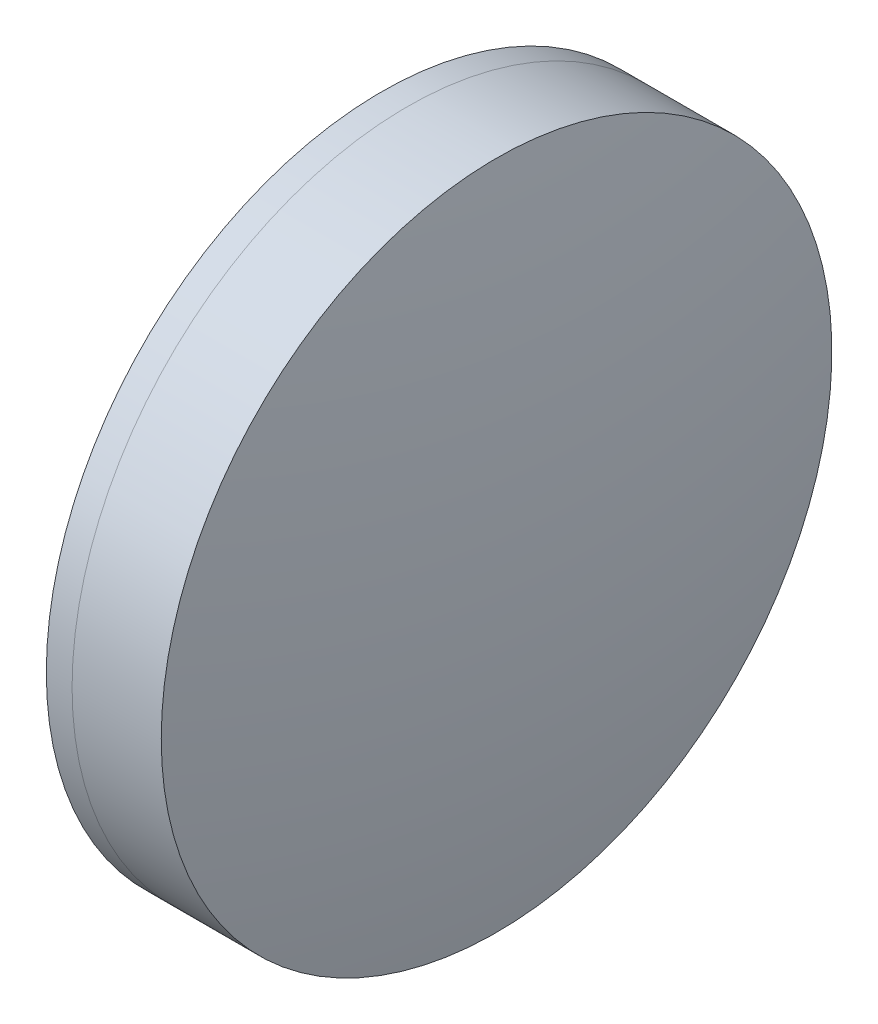
ISO-10303-21;
HEADER;
FILE_DESCRIPTION(('STEP AP214'),'2;1');
FILE_NAME('part.step','',(''),(''),'','','');
FILE_SCHEMA(('AUTOMOTIVE_DESIGN { 1 0 10303 214 1 1 1 1 }'));
ENDSEC;
DATA;
#1=APPLICATION_CONTEXT('core data for automotive mechanical design processes');
#2=APPLICATION_PROTOCOL_DEFINITION('international standard','automotive_design',2000,#1);
#3=PRODUCT_CONTEXT('',#1,'mechanical');
#4=PRODUCT('Part','Part','',(#3));
#5=PRODUCT_RELATED_PRODUCT_CATEGORY('part','',(#4));
#6=PRODUCT_DEFINITION_FORMATION('','',#4);
#7=PRODUCT_DEFINITION_CONTEXT('part definition',#1,'design');
#8=PRODUCT_DEFINITION('design','',#6,#7);
#9=PRODUCT_DEFINITION_SHAPE('','',#8);
#10=(LENGTH_UNIT() NAMED_UNIT(*) SI_UNIT(.MILLI.,.METRE.));
#11=(NAMED_UNIT(*) PLANE_ANGLE_UNIT() SI_UNIT($,.RADIAN.));
#12=(NAMED_UNIT(*) SI_UNIT($,.STERADIAN.) SOLID_ANGLE_UNIT());
#13=UNCERTAINTY_MEASURE_WITH_UNIT(LENGTH_MEASURE(1.E-05),#10,'distance_accuracy_value','');
#14=(GEOMETRIC_REPRESENTATION_CONTEXT(3) GLOBAL_UNCERTAINTY_ASSIGNED_CONTEXT((#13)) GLOBAL_UNIT_ASSIGNED_CONTEXT((#10,
#11,#12)) REPRESENTATION_CONTEXT('',''));
#15=CARTESIAN_POINT('',(0.,0.,0.));
#16=DIRECTION('',(0.,0.,1.));
#17=DIRECTION('',(1.,0.,0.));
#18=AXIS2_PLACEMENT_3D('',#15,#16,#17);
#19=CARTESIAN_POINT('',(181.48845515743,0.,0.));
#20=DIRECTION('',(-1.,0.,0.));
#21=DIRECTION('',(0.,0.,1.));
#22=AXIS2_PLACEMENT_3D('',#19,#20,#21);
#23=SPHERICAL_SURFACE('',#22,48.197);
#24=CARTESIAN_POINT('',(222.694653829474,0.,0.));
#25=DIRECTION('',(-1.,0.,0.));
#26=DIRECTION('',(0.,0.,1.));
#27=AXIS2_PLACEMENT_3D('',#24,#25,#26);
#28=CIRCLE('',#27,25.);
#29=CARTESIAN_POINT('',(222.694653829474,0.,25.));
#30=VERTEX_POINT('',#29);
#31=EDGE_CURVE('E11',#30,#30,#28,.T.);
#32=ORIENTED_EDGE('',*,*,#31,.T.);
#33=EDGE_LOOP('',(#32));
#34=FACE_BOUND('',#33,.T.);
#35=ADVANCED_FACE('F45',(#34),#23,.F.);
#36=CARTESIAN_POINT('',(-0.551919992657797,0.,0.));
#37=DIRECTION('',(-1.,0.,0.));
#38=DIRECTION('',(0.,0.,1.));
#39=AXIS2_PLACEMENT_3D('',#36,#37,#38);
#40=CYLINDRICAL_SURFACE('',#39,25.);
#41=CARTESIAN_POINT('',(229.343243300927,0.,0.));
#42=DIRECTION('',(-1.,0.,0.));
#43=DIRECTION('',(0.,0.,1.));
#44=AXIS2_PLACEMENT_3D('',#41,#42,#43);
#45=CIRCLE('',#44,25.);
#46=CARTESIAN_POINT('',(229.343243300927,0.,25.));
#47=VERTEX_POINT('',#46);
#48=EDGE_CURVE('E51',#47,#47,#45,.T.);
#49=ORIENTED_EDGE('',*,*,#48,.T.);
#50=EDGE_LOOP('',(#49));
#51=FACE_BOUND('',#50,.T.);
#52=ORIENTED_EDGE('',*,*,#31,.F.);
#53=EDGE_LOOP('',(#52));
#54=FACE_BOUND('',#53,.T.);
#55=ADVANCED_FACE('F57',(#51,#54),#40,.T.);
#56=CARTESIAN_POINT('',(97.0934551574296,0.,0.));
#57=DIRECTION('',(-1.,0.,0.));
#58=DIRECTION('',(0.,0.,1.));
#59=AXIS2_PLACEMENT_3D('',#56,#57,#58);
#60=SPHERICAL_SURFACE('',#59,134.592);
#61=ORIENTED_EDGE('',*,*,#48,.F.);
#62=EDGE_LOOP('',(#61));
#63=FACE_BOUND('',#62,.T.);
#64=ADVANCED_FACE('F60',(#63),#60,.T.);
#65=CLOSED_SHELL('',(#35,#55,#64));
#66=MANIFOLD_SOLID_BREP('B2',#65);
#67=CARTESIAN_POINT('',(281.05545515743,0.,0.));
#68=DIRECTION('',(-1.,0.,0.));
#69=DIRECTION('',(0.,0.,1.));
#70=AXIS2_PLACEMENT_3D('',#67,#68,#69);
#71=SPHERICAL_SURFACE('',#70,65.26);
#72=CARTESIAN_POINT('',(220.773885834792,0.,0.));
#73=DIRECTION('',(-1.,0.,0.));
#74=DIRECTION('',(0.,0.,1.));
#75=AXIS2_PLACEMENT_3D('',#72,#73,#74);
#76=CIRCLE('',#75,25.);
#77=CARTESIAN_POINT('',(220.773885834792,0.,25.));
#78=VERTEX_POINT('',#77);
#79=EDGE_CURVE('E44',#78,#78,#76,.T.);
#80=ORIENTED_EDGE('',*,*,#79,.T.);
#81=EDGE_LOOP('',(#80));
#82=FACE_BOUND('',#81,.T.);
#83=ADVANCED_FACE('F86',(#82),#71,.T.);
#84=CARTESIAN_POINT('',(124.523309526045,0.,0.));
#85=DIRECTION('',(-1.,0.,0.));
#86=DIRECTION('',(0.,0.,1.));
#87=AXIS2_PLACEMENT_3D('',#84,#85,#86);
#88=CYLINDRICAL_SURFACE('',#87,25.);
#89=CARTESIAN_POINT('',(222.694653829474,0.,0.));
#90=DIRECTION('',(-1.,0.,0.));
#91=DIRECTION('',(0.,0.,1.));
#92=AXIS2_PLACEMENT_3D('',#89,#90,#91);
#93=CIRCLE('',#92,25.);
#94=CARTESIAN_POINT('',(222.694653829474,0.,25.));
#95=VERTEX_POINT('',#94);
#96=EDGE_CURVE('E92',#95,#95,#93,.T.);
#97=ORIENTED_EDGE('',*,*,#96,.T.);
#98=EDGE_LOOP('',(#97));
#99=FACE_BOUND('',#98,.T.);
#100=ORIENTED_EDGE('',*,*,#79,.F.);
#101=EDGE_LOOP('',(#100));
#102=FACE_BOUND('',#101,.T.);
#103=ADVANCED_FACE('F98',(#99,#102),#88,.T.);
#104=CARTESIAN_POINT('',(181.48845515743,0.,0.));
#105=DIRECTION('',(-1.,0.,0.));
#106=DIRECTION('',(0.,0.,1.));
#107=AXIS2_PLACEMENT_3D('',#104,#105,#106);
#108=SPHERICAL_SURFACE('',#107,48.197);
#109=ORIENTED_EDGE('',*,*,#96,.F.);
#110=EDGE_LOOP('',(#109));
#111=FACE_BOUND('',#110,.T.);
#112=ADVANCED_FACE('F101',(#111),#108,.T.);
#113=CLOSED_SHELL('',(#83,#103,#112));
#114=MANIFOLD_SOLID_BREP('B6',#113);
#115=ADVANCED_BREP_SHAPE_REPRESENTATION('',(#18,#66,#114),#14);
#116=SHAPE_DEFINITION_REPRESENTATION(#9,#115);
ENDSEC;
END-ISO-10303-21;
